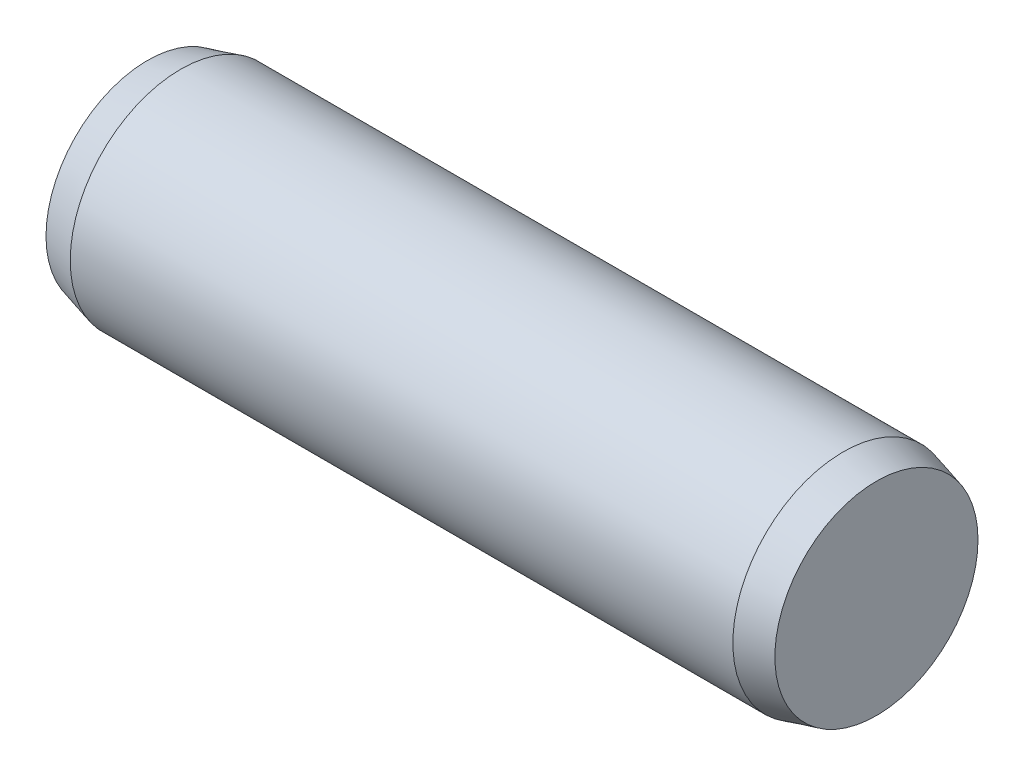
ISO-10303-21;
HEADER;
FILE_DESCRIPTION(('STEP AP214'),'2;1');
FILE_NAME('part.step','',(''),(''),'','','');
FILE_SCHEMA(('AUTOMOTIVE_DESIGN { 1 0 10303 214 1 1 1 1 }'));
ENDSEC;
DATA;
#1=APPLICATION_CONTEXT('core data for automotive mechanical design processes');
#2=APPLICATION_PROTOCOL_DEFINITION('international standard','automotive_design',2000,#1);
#3=PRODUCT_CONTEXT('',#1,'mechanical');
#4=PRODUCT('Part','Part','',(#3));
#5=PRODUCT_RELATED_PRODUCT_CATEGORY('part','',(#4));
#6=PRODUCT_DEFINITION_FORMATION('','',#4);
#7=PRODUCT_DEFINITION_CONTEXT('part definition',#1,'design');
#8=PRODUCT_DEFINITION('design','',#6,#7);
#9=PRODUCT_DEFINITION_SHAPE('','',#8);
#10=(LENGTH_UNIT() NAMED_UNIT(*) SI_UNIT(.MILLI.,.METRE.));
#11=(NAMED_UNIT(*) PLANE_ANGLE_UNIT() SI_UNIT($,.RADIAN.));
#12=(NAMED_UNIT(*) SI_UNIT($,.STERADIAN.) SOLID_ANGLE_UNIT());
#13=UNCERTAINTY_MEASURE_WITH_UNIT(LENGTH_MEASURE(1.E-05),#10,'distance_accuracy_value','');
#14=(GEOMETRIC_REPRESENTATION_CONTEXT(3) GLOBAL_UNCERTAINTY_ASSIGNED_CONTEXT((#13)) GLOBAL_UNIT_ASSIGNED_CONTEXT((#10,
#11,#12)) REPRESENTATION_CONTEXT('',''));
#15=CARTESIAN_POINT('',(0.,0.,0.));
#16=DIRECTION('',(0.,0.,1.));
#17=DIRECTION('',(1.,0.,0.));
#18=AXIS2_PLACEMENT_3D('',#15,#16,#17);
#19=CARTESIAN_POINT('',(-3.,0.,0.));
#20=DIRECTION('',(1.,0.,0.));
#21=DIRECTION('',(0.,0.,-1.));
#22=AXIS2_PLACEMENT_3D('',#19,#20,#21);
#23=CYLINDRICAL_SURFACE('',#22,1.);
#24=CARTESIAN_POINT('',(-3.,0.,0.));
#25=DIRECTION('',(-1.,0.,0.));
#26=DIRECTION('',(0.,0.,1.));
#27=AXIS2_PLACEMENT_3D('',#24,#25,#26);
#28=CIRCLE('',#27,1.);
#29=CARTESIAN_POINT('',(-3.,0.,1.));
#30=VERTEX_POINT('',#29);
#31=EDGE_CURVE('E44',#30,#30,#28,.T.);
#32=ORIENTED_EDGE('',*,*,#31,.F.);
#33=EDGE_LOOP('',(#32));
#34=FACE_BOUND('',#33,.T.);
#35=CARTESIAN_POINT('',(3.,0.,0.));
#36=DIRECTION('',(1.,0.,0.));
#37=DIRECTION('',(0.,0.,-1.));
#38=AXIS2_PLACEMENT_3D('',#35,#36,#37);
#39=CIRCLE('',#38,1.);
#40=CARTESIAN_POINT('',(3.,0.,-1.));
#41=VERTEX_POINT('',#40);
#42=EDGE_CURVE('E10',#41,#41,#39,.T.);
#43=ORIENTED_EDGE('',*,*,#42,.F.);
#44=EDGE_LOOP('',(#43));
#45=FACE_BOUND('',#44,.T.);
#46=ADVANCED_FACE('F30',(#34,#45),#23,.T.);
#47=CARTESIAN_POINT('',(3.,0.,0.));
#48=DIRECTION('',(-1.,0.,0.));
#49=DIRECTION('',(0.,0.,-1.));
#50=AXIS2_PLACEMENT_3D('',#47,#48,#49);
#51=CONICAL_SURFACE('',#50,1.,0.26179938779915);
#52=CARTESIAN_POINT('',(3.3,0.,0.));
#53=DIRECTION('',(1.,0.,0.));
#54=DIRECTION('',(0.,0.,-1.));
#55=AXIS2_PLACEMENT_3D('',#52,#53,#54);
#56=CIRCLE('',#55,0.919615242270665);
#57=CARTESIAN_POINT('',(3.3,0.,-0.919615242270665));
#58=VERTEX_POINT('',#57);
#59=EDGE_CURVE('E36',#58,#58,#56,.T.);
#60=ORIENTED_EDGE('',*,*,#59,.F.);
#61=EDGE_LOOP('',(#60));
#62=FACE_BOUND('',#61,.T.);
#63=ORIENTED_EDGE('',*,*,#42,.T.);
#64=EDGE_LOOP('',(#63));
#65=FACE_BOUND('',#64,.T.);
#66=ADVANCED_FACE('F54',(#62,#65),#51,.T.);
#67=CARTESIAN_POINT('',(3.3,0.,0.));
#68=DIRECTION('',(1.,0.,0.));
#69=DIRECTION('',(0.,0.,-1.));
#70=AXIS2_PLACEMENT_3D('',#67,#68,#69);
#71=PLANE('',#70);
#72=ORIENTED_EDGE('',*,*,#59,.T.);
#73=EDGE_LOOP('',(#72));
#74=FACE_BOUND('',#73,.T.);
#75=ADVANCED_FACE('F58',(#74),#71,.T.);
#76=CARTESIAN_POINT('',(-3.,0.,0.));
#77=DIRECTION('',(1.,0.,0.));
#78=DIRECTION('',(0.,0.,1.));
#79=AXIS2_PLACEMENT_3D('',#76,#77,#78);
#80=CONICAL_SURFACE('',#79,1.,0.26179938779915);
#81=CARTESIAN_POINT('',(-3.3,0.,0.));
#82=DIRECTION('',(-1.,0.,0.));
#83=DIRECTION('',(0.,0.,1.));
#84=AXIS2_PLACEMENT_3D('',#81,#82,#83);
#85=CIRCLE('',#84,0.919615242270665);
#86=CARTESIAN_POINT('',(-3.3,0.,0.919615242270665));
#87=VERTEX_POINT('',#86);
#88=EDGE_CURVE('E40',#87,#87,#85,.T.);
#89=ORIENTED_EDGE('',*,*,#88,.F.);
#90=EDGE_LOOP('',(#89));
#91=FACE_BOUND('',#90,.T.);
#92=ORIENTED_EDGE('',*,*,#31,.T.);
#93=EDGE_LOOP('',(#92));
#94=FACE_BOUND('',#93,.T.);
#95=ADVANCED_FACE('F50',(#91,#94),#80,.T.);
#96=CARTESIAN_POINT('',(-3.3,0.,0.));
#97=DIRECTION('',(-1.,0.,0.));
#98=DIRECTION('',(0.,0.,1.));
#99=AXIS2_PLACEMENT_3D('',#96,#97,#98);
#100=PLANE('',#99);
#101=ORIENTED_EDGE('',*,*,#88,.T.);
#102=EDGE_LOOP('',(#101));
#103=FACE_BOUND('',#102,.T.);
#104=ADVANCED_FACE('F67',(#103),#100,.T.);
#105=CLOSED_SHELL('',(#46,#66,#75,#95,#104));
#106=MANIFOLD_SOLID_BREP('B2',#105);
#107=ADVANCED_BREP_SHAPE_REPRESENTATION('',(#18,#106),#14);
#108=SHAPE_DEFINITION_REPRESENTATION(#9,#107);
ENDSEC;
END-ISO-10303-21;
